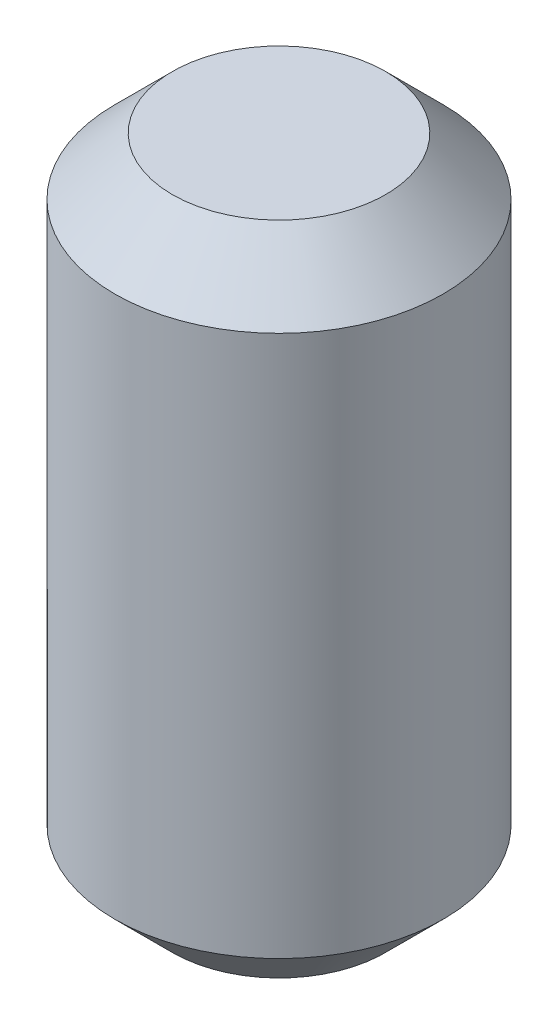
ISO-10303-21;
HEADER;
FILE_DESCRIPTION(('STEP AP214'),'2;1');
FILE_NAME('part.step','',(''),(''),'','','');
FILE_SCHEMA(('AUTOMOTIVE_DESIGN { 1 0 10303 214 1 1 1 1 }'));
ENDSEC;
DATA;
#1=APPLICATION_CONTEXT('core data for automotive mechanical design processes');
#2=APPLICATION_PROTOCOL_DEFINITION('international standard','automotive_design',2000,#1);
#3=PRODUCT_CONTEXT('',#1,'mechanical');
#4=PRODUCT('Part','Part','',(#3));
#5=PRODUCT_RELATED_PRODUCT_CATEGORY('part','',(#4));
#6=PRODUCT_DEFINITION_FORMATION('','',#4);
#7=PRODUCT_DEFINITION_CONTEXT('part definition',#1,'design');
#8=PRODUCT_DEFINITION('design','',#6,#7);
#9=PRODUCT_DEFINITION_SHAPE('','',#8);
#10=(LENGTH_UNIT() NAMED_UNIT(*) SI_UNIT(.MILLI.,.METRE.));
#11=(NAMED_UNIT(*) PLANE_ANGLE_UNIT() SI_UNIT($,.RADIAN.));
#12=(NAMED_UNIT(*) SI_UNIT($,.STERADIAN.) SOLID_ANGLE_UNIT());
#13=UNCERTAINTY_MEASURE_WITH_UNIT(LENGTH_MEASURE(1.E-05),#10,'distance_accuracy_value','');
#14=(GEOMETRIC_REPRESENTATION_CONTEXT(3) GLOBAL_UNCERTAINTY_ASSIGNED_CONTEXT((#13)) GLOBAL_UNIT_ASSIGNED_CONTEXT((#10,
#11,#12)) REPRESENTATION_CONTEXT('',''));
#15=CARTESIAN_POINT('',(0.,0.,0.));
#16=DIRECTION('',(0.,0.,1.));
#17=DIRECTION('',(1.,0.,0.));
#18=AXIS2_PLACEMENT_3D('',#15,#16,#17);
#19=CARTESIAN_POINT('',(0.,0.,0.));
#20=DIRECTION('',(0.,1.,0.));
#21=DIRECTION('',(0.,0.,1.));
#22=AXIS2_PLACEMENT_3D('',#19,#20,#21);
#23=PLANE('',#22);
#24=CARTESIAN_POINT('',(0.,5.6843418860808E-11,0.));
#25=DIRECTION('',(0.,-1.,0.));
#26=DIRECTION('',(0.,0.,-1.));
#27=AXIS2_PLACEMENT_3D('',#24,#25,#26);
#28=CIRCLE('',#27,6.50000000001683);
#29=CARTESIAN_POINT('',(0.,5.6843418860808E-11,-6.50000000001683));
#30=VERTEX_POINT('',#29);
#31=EDGE_CURVE('E18',#30,#30,#28,.T.);
#32=ORIENTED_EDGE('',*,*,#31,.F.);
#33=EDGE_LOOP('',(#32));
#34=FACE_BOUND('',#33,.T.);
#35=ADVANCED_FACE('F15',(#34),#23,.T.);
#36=CARTESIAN_POINT('',(0.,-40.,0.));
#37=DIRECTION('',(0.,1.,0.));
#38=DIRECTION('',(0.,0.,1.));
#39=AXIS2_PLACEMENT_3D('',#36,#37,#38);
#40=PLANE('',#39);
#41=CARTESIAN_POINT('',(0.,-40.0000000000773,0.));
#42=DIRECTION('',(0.,1.,0.));
#43=DIRECTION('',(0.,0.,1.));
#44=AXIS2_PLACEMENT_3D('',#41,#42,#43);
#45=CIRCLE('',#44,6.50000000001683);
#46=CARTESIAN_POINT('',(0.,-40.0000000000773,6.50000000001683));
#47=VERTEX_POINT('',#46);
#48=EDGE_CURVE('E27',#47,#47,#45,.T.);
#49=ORIENTED_EDGE('',*,*,#48,.F.);
#50=EDGE_LOOP('',(#49));
#51=FACE_BOUND('',#50,.T.);
#52=ADVANCED_FACE('F38',(#51),#40,.F.);
#53=CARTESIAN_POINT('',(0.,-3.49999999991724,0.));
#54=DIRECTION('',(0.,-1.,0.));
#55=DIRECTION('',(0.,0.,-1.));
#56=AXIS2_PLACEMENT_3D('',#53,#54,#55);
#57=CONICAL_SURFACE('',#56,9.99999999999091,0.785398163397448);
#58=CARTESIAN_POINT('',(0.,-3.5,0.));
#59=DIRECTION('',(0.,1.,0.));
#60=DIRECTION('',(0.,0.,1.));
#61=AXIS2_PLACEMENT_3D('',#58,#59,#60);
#62=CIRCLE('',#61,10.);
#63=CARTESIAN_POINT('',(0.,-3.5,10.));
#64=VERTEX_POINT('',#63);
#65=EDGE_CURVE('E22',#64,#64,#62,.F.);
#66=ORIENTED_EDGE('',*,*,#65,.F.);
#67=EDGE_LOOP('',(#66));
#68=FACE_BOUND('',#67,.T.);
#69=ORIENTED_EDGE('',*,*,#31,.T.);
#70=EDGE_LOOP('',(#69));
#71=FACE_BOUND('',#70,.T.);
#72=ADVANCED_FACE('F35',(#68,#71),#57,.T.);
#73=CARTESIAN_POINT('',(0.,-36.5000000001032,0.));
#74=DIRECTION('',(0.,1.,0.));
#75=DIRECTION('',(0.,0.,1.));
#76=AXIS2_PLACEMENT_3D('',#73,#74,#75);
#77=CONICAL_SURFACE('',#76,9.99999999999091,0.785398163397448);
#78=ORIENTED_EDGE('',*,*,#48,.T.);
#79=EDGE_LOOP('',(#78));
#80=FACE_BOUND('',#79,.T.);
#81=CARTESIAN_POINT('',(0.,-36.5,0.));
#82=DIRECTION('',(0.,1.,0.));
#83=DIRECTION('',(0.,0.,1.));
#84=AXIS2_PLACEMENT_3D('',#81,#82,#83);
#85=CIRCLE('',#84,10.);
#86=CARTESIAN_POINT('',(0.,-36.5,10.));
#87=VERTEX_POINT('',#86);
#88=EDGE_CURVE('E10',#87,#87,#85,.T.);
#89=ORIENTED_EDGE('',*,*,#88,.F.);
#90=EDGE_LOOP('',(#89));
#91=FACE_BOUND('',#90,.T.);
#92=ADVANCED_FACE('F46',(#80,#91),#77,.T.);
#93=CARTESIAN_POINT('',(0.,-42.,0.));
#94=DIRECTION('',(0.,1.,0.));
#95=DIRECTION('',(0.,0.,1.));
#96=AXIS2_PLACEMENT_3D('',#93,#94,#95);
#97=CYLINDRICAL_SURFACE('',#96,10.);
#98=ORIENTED_EDGE('',*,*,#88,.T.);
#99=EDGE_LOOP('',(#98));
#100=FACE_BOUND('',#99,.T.);
#101=ORIENTED_EDGE('',*,*,#65,.T.);
#102=EDGE_LOOP('',(#101));
#103=FACE_BOUND('',#102,.T.);
#104=ADVANCED_FACE('F44',(#100,#103),#97,.T.);
#105=CLOSED_SHELL('',(#35,#52,#72,#92,#104));
#106=MANIFOLD_SOLID_BREP('B1',#105);
#107=ADVANCED_BREP_SHAPE_REPRESENTATION('',(#18,#106),#14);
#108=SHAPE_DEFINITION_REPRESENTATION(#9,#107);
ENDSEC;
END-ISO-10303-21;
